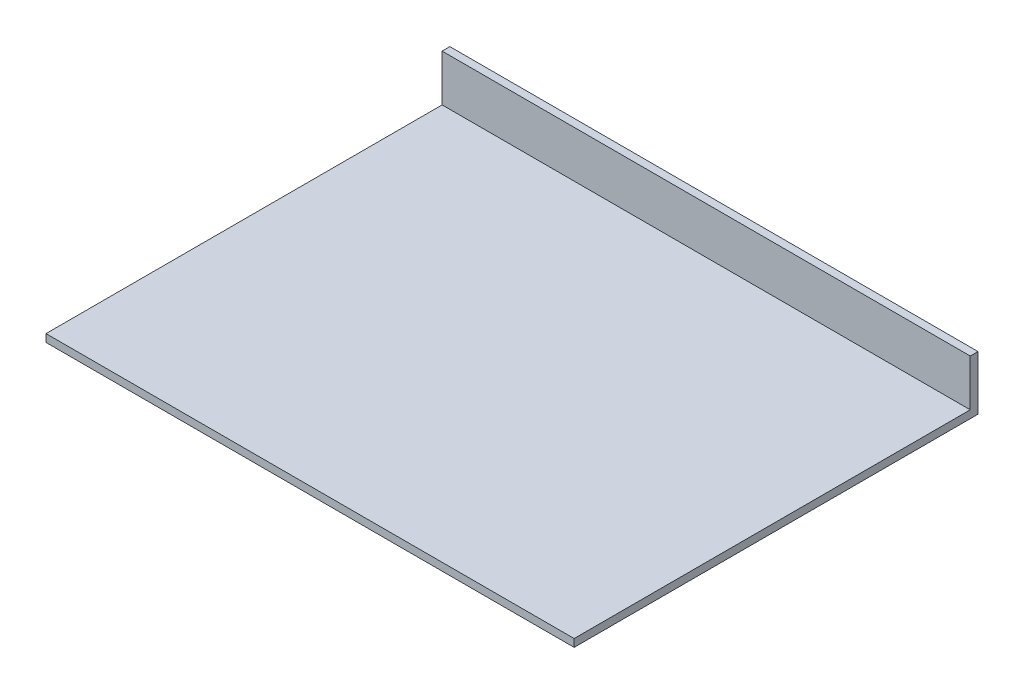
ISO-10303-21;
HEADER;
FILE_DESCRIPTION(('STEP AP214'),'2;1');
FILE_NAME('part.step','',(''),(''),'','','');
FILE_SCHEMA(('AUTOMOTIVE_DESIGN { 1 0 10303 214 1 1 1 1 }'));
ENDSEC;
DATA;
#1=APPLICATION_CONTEXT('core data for automotive mechanical design processes');
#2=APPLICATION_PROTOCOL_DEFINITION('international standard','automotive_design',2000,#1);
#3=PRODUCT_CONTEXT('',#1,'mechanical');
#4=PRODUCT('Part','Part','',(#3));
#5=PRODUCT_RELATED_PRODUCT_CATEGORY('part','',(#4));
#6=PRODUCT_DEFINITION_FORMATION('','',#4);
#7=PRODUCT_DEFINITION_CONTEXT('part definition',#1,'design');
#8=PRODUCT_DEFINITION('design','',#6,#7);
#9=PRODUCT_DEFINITION_SHAPE('','',#8);
#10=(LENGTH_UNIT() NAMED_UNIT(*) SI_UNIT(.MILLI.,.METRE.));
#11=(NAMED_UNIT(*) PLANE_ANGLE_UNIT() SI_UNIT($,.RADIAN.));
#12=(NAMED_UNIT(*) SI_UNIT($,.STERADIAN.) SOLID_ANGLE_UNIT());
#13=UNCERTAINTY_MEASURE_WITH_UNIT(LENGTH_MEASURE(1.E-05),#10,'distance_accuracy_value','');
#14=(GEOMETRIC_REPRESENTATION_CONTEXT(3) GLOBAL_UNCERTAINTY_ASSIGNED_CONTEXT((#13)) GLOBAL_UNIT_ASSIGNED_CONTEXT((#10,
#11,#12)) REPRESENTATION_CONTEXT('',''));
#15=CARTESIAN_POINT('',(0.,0.,0.));
#16=DIRECTION('',(0.,0.,1.));
#17=DIRECTION('',(1.,0.,0.));
#18=AXIS2_PLACEMENT_3D('',#15,#16,#17);
#19=CARTESIAN_POINT('',(0.,3.14770541141642,0.));
#20=DIRECTION('',(0.,-1.,0.));
#21=DIRECTION('',(0.,0.,-1.));
#22=AXIS2_PLACEMENT_3D('',#19,#20,#21);
#23=PLANE('',#22);
#24=DIRECTION('',(1.,0.,0.));
#25=VECTOR('',#24,1.);
#26=CARTESIAN_POINT('',(-107.95,3.14770541141642,-79.375));
#27=LINE('',#26,#25);
#28=CARTESIAN_POINT('',(-107.95,3.14770541141642,-79.375));
#29=VERTEX_POINT('',#28);
#30=CARTESIAN_POINT('',(107.95,3.14770541141642,-79.375));
#31=VERTEX_POINT('',#30);
#32=EDGE_CURVE('E55',#29,#31,#27,.T.);
#33=ORIENTED_EDGE('',*,*,#32,.F.);
#34=DIRECTION('',(0.,0.,1.));
#35=VECTOR('',#34,1.);
#36=CARTESIAN_POINT('',(-107.95,3.14770541141642,82.55));
#37=LINE('',#36,#35);
#38=CARTESIAN_POINT('',(-107.95,3.14770541141642,82.55));
#39=VERTEX_POINT('',#38);
#40=EDGE_CURVE('E153',#29,#39,#37,.T.);
#41=ORIENTED_EDGE('',*,*,#40,.T.);
#42=DIRECTION('',(1.,0.,0.));
#43=VECTOR('',#42,1.);
#44=CARTESIAN_POINT('',(-107.95,3.14770541141642,82.55));
#45=LINE('',#44,#43);
#46=CARTESIAN_POINT('',(107.95,3.14770541141642,82.55));
#47=VERTEX_POINT('',#46);
#48=EDGE_CURVE('E61',#39,#47,#45,.T.);
#49=ORIENTED_EDGE('',*,*,#48,.T.);
#50=DIRECTION('',(0.,0.,-1.));
#51=VECTOR('',#50,1.);
#52=CARTESIAN_POINT('',(107.95,3.14770541141642,82.55));
#53=LINE('',#52,#51);
#54=EDGE_CURVE('E91',#47,#31,#53,.T.);
#55=ORIENTED_EDGE('',*,*,#54,.T.);
#56=EDGE_LOOP('',(#33,#41,#49,#55));
#57=FACE_BOUND('',#56,.T.);
#58=ADVANCED_FACE('F39',(#57),#23,.F.);
#59=CARTESIAN_POINT('',(107.95,3.14770541141642,82.55));
#60=DIRECTION('',(-1.,0.,0.));
#61=DIRECTION('',(0.,0.,1.));
#62=AXIS2_PLACEMENT_3D('',#59,#60,#61);
#63=PLANE('',#62);
#64=DIRECTION('',(0.,0.,-1.));
#65=VECTOR('',#64,1.);
#66=CARTESIAN_POINT('',(107.95,0.,82.55));
#67=LINE('',#66,#65);
#68=CARTESIAN_POINT('',(107.95,0.,82.55));
#69=VERTEX_POINT('',#68);
#70=CARTESIAN_POINT('',(107.95,0.,-82.55));
#71=VERTEX_POINT('',#70);
#72=EDGE_CURVE('E97',#69,#71,#67,.T.);
#73=ORIENTED_EDGE('',*,*,#72,.T.);
#74=DIRECTION('',(0.,-1.,0.));
#75=VECTOR('',#74,1.);
#76=CARTESIAN_POINT('',(107.95,3.14770541141642,-82.55));
#77=LINE('',#76,#75);
#78=CARTESIAN_POINT('',(107.95,22.1977054114164,-82.55));
#79=VERTEX_POINT('',#78);
#80=EDGE_CURVE('E11',#79,#71,#77,.T.);
#81=ORIENTED_EDGE('',*,*,#80,.F.);
#82=DIRECTION('',(0.,0.,-1.));
#83=VECTOR('',#82,1.);
#84=CARTESIAN_POINT('',(107.95,22.1977054114164,-82.55));
#85=LINE('',#84,#83);
#86=CARTESIAN_POINT('',(107.95,22.1977054114164,-79.375));
#87=VERTEX_POINT('',#86);
#88=EDGE_CURVE('E140',#87,#79,#85,.T.);
#89=ORIENTED_EDGE('',*,*,#88,.F.);
#90=DIRECTION('',(0.,-1.,0.));
#91=VECTOR('',#90,1.);
#92=CARTESIAN_POINT('',(107.95,22.1977054114164,-79.375));
#93=LINE('',#92,#91);
#94=EDGE_CURVE('E110',#87,#31,#93,.T.);
#95=ORIENTED_EDGE('',*,*,#94,.T.);
#96=ORIENTED_EDGE('',*,*,#54,.F.);
#97=DIRECTION('',(0.,-1.,0.));
#98=VECTOR('',#97,1.);
#99=CARTESIAN_POINT('',(107.95,3.14770541141642,82.55));
#100=LINE('',#99,#98);
#101=EDGE_CURVE('E83',#47,#69,#100,.T.);
#102=ORIENTED_EDGE('',*,*,#101,.T.);
#103=EDGE_LOOP('',(#73,#81,#89,#95,#96,#102));
#104=FACE_BOUND('',#103,.T.);
#105=ADVANCED_FACE('F41',(#104),#63,.F.);
#106=CARTESIAN_POINT('',(-107.95,3.14770541141642,-82.55));
#107=DIRECTION('',(0.,0.,1.));
#108=DIRECTION('',(1.,0.,0.));
#109=AXIS2_PLACEMENT_3D('',#106,#107,#108);
#110=PLANE('',#109);
#111=DIRECTION('',(-1.,0.,0.));
#112=VECTOR('',#111,1.);
#113=CARTESIAN_POINT('',(-107.95,0.,-82.55));
#114=LINE('',#113,#112);
#115=CARTESIAN_POINT('',(-107.95,0.,-82.55));
#116=VERTEX_POINT('',#115);
#117=EDGE_CURVE('E102',#71,#116,#114,.T.);
#118=ORIENTED_EDGE('',*,*,#117,.T.);
#119=DIRECTION('',(0.,-1.,0.));
#120=VECTOR('',#119,1.);
#121=CARTESIAN_POINT('',(-107.95,3.14770541141642,-82.55));
#122=LINE('',#121,#120);
#123=CARTESIAN_POINT('',(-107.95,22.1977054114164,-82.55));
#124=VERTEX_POINT('',#123);
#125=EDGE_CURVE('E48',#124,#116,#122,.T.);
#126=ORIENTED_EDGE('',*,*,#125,.F.);
#127=DIRECTION('',(-1.,0.,0.));
#128=VECTOR('',#127,1.);
#129=CARTESIAN_POINT('',(-107.95,22.1977054114164,-82.55));
#130=LINE('',#129,#128);
#131=EDGE_CURVE('E132',#79,#124,#130,.T.);
#132=ORIENTED_EDGE('',*,*,#131,.F.);
#133=ORIENTED_EDGE('',*,*,#80,.T.);
#134=EDGE_LOOP('',(#118,#126,#132,#133));
#135=FACE_BOUND('',#134,.T.);
#136=ADVANCED_FACE('F130',(#135),#110,.F.);
#137=CARTESIAN_POINT('',(-107.95,3.14770541141642,82.55));
#138=DIRECTION('',(1.,0.,0.));
#139=DIRECTION('',(0.,0.,-1.));
#140=AXIS2_PLACEMENT_3D('',#137,#138,#139);
#141=PLANE('',#140);
#142=DIRECTION('',(0.,0.,1.));
#143=VECTOR('',#142,1.);
#144=CARTESIAN_POINT('',(-107.95,0.,82.55));
#145=LINE('',#144,#143);
#146=CARTESIAN_POINT('',(-107.95,0.,82.55));
#147=VERTEX_POINT('',#146);
#148=EDGE_CURVE('E92',#116,#147,#145,.T.);
#149=ORIENTED_EDGE('',*,*,#148,.T.);
#150=DIRECTION('',(0.,-1.,0.));
#151=VECTOR('',#150,1.);
#152=CARTESIAN_POINT('',(-107.95,3.14770541141642,82.55));
#153=LINE('',#152,#151);
#154=EDGE_CURVE('E86',#39,#147,#153,.T.);
#155=ORIENTED_EDGE('',*,*,#154,.F.);
#156=ORIENTED_EDGE('',*,*,#40,.F.);
#157=DIRECTION('',(0.,-1.,0.));
#158=VECTOR('',#157,1.);
#159=CARTESIAN_POINT('',(-107.95,22.1977054114164,-79.375));
#160=LINE('',#159,#158);
#161=CARTESIAN_POINT('',(-107.95,22.1977054114164,-79.375));
#162=VERTEX_POINT('',#161);
#163=EDGE_CURVE('E104',#162,#29,#160,.T.);
#164=ORIENTED_EDGE('',*,*,#163,.F.);
#165=DIRECTION('',(0.,0.,1.));
#166=VECTOR('',#165,1.);
#167=CARTESIAN_POINT('',(-107.95,22.1977054114164,-82.55));
#168=LINE('',#167,#166);
#169=EDGE_CURVE('E126',#124,#162,#168,.T.);
#170=ORIENTED_EDGE('',*,*,#169,.F.);
#171=ORIENTED_EDGE('',*,*,#125,.T.);
#172=EDGE_LOOP('',(#149,#155,#156,#164,#170,#171));
#173=FACE_BOUND('',#172,.T.);
#174=ADVANCED_FACE('F123',(#173),#141,.F.);
#175=CARTESIAN_POINT('',(-107.95,3.14770541141642,82.55));
#176=DIRECTION('',(0.,0.,-1.));
#177=DIRECTION('',(-1.,0.,0.));
#178=AXIS2_PLACEMENT_3D('',#175,#176,#177);
#179=PLANE('',#178);
#180=DIRECTION('',(1.,0.,0.));
#181=VECTOR('',#180,1.);
#182=CARTESIAN_POINT('',(-107.95,0.,82.55));
#183=LINE('',#182,#181);
#184=EDGE_CURVE('E80',#147,#69,#183,.T.);
#185=ORIENTED_EDGE('',*,*,#184,.T.);
#186=ORIENTED_EDGE('',*,*,#101,.F.);
#187=ORIENTED_EDGE('',*,*,#48,.F.);
#188=ORIENTED_EDGE('',*,*,#154,.T.);
#189=EDGE_LOOP('',(#185,#186,#187,#188));
#190=FACE_BOUND('',#189,.T.);
#191=ADVANCED_FACE('F82',(#190),#179,.F.);
#192=CARTESIAN_POINT('',(0.,0.,0.));
#193=DIRECTION('',(0.,-1.,0.));
#194=DIRECTION('',(0.,0.,-1.));
#195=AXIS2_PLACEMENT_3D('',#192,#193,#194);
#196=PLANE('',#195);
#197=ORIENTED_EDGE('',*,*,#72,.F.);
#198=ORIENTED_EDGE('',*,*,#184,.F.);
#199=ORIENTED_EDGE('',*,*,#148,.F.);
#200=ORIENTED_EDGE('',*,*,#117,.F.);
#201=EDGE_LOOP('',(#197,#198,#199,#200));
#202=FACE_BOUND('',#201,.T.);
#203=ADVANCED_FACE('F101',(#202),#196,.T.);
#204=CARTESIAN_POINT('',(-107.95,22.1977054114164,-79.375));
#205=DIRECTION('',(0.,0.,-1.));
#206=DIRECTION('',(-1.,0.,0.));
#207=AXIS2_PLACEMENT_3D('',#204,#205,#206);
#208=PLANE('',#207);
#209=ORIENTED_EDGE('',*,*,#32,.T.);
#210=ORIENTED_EDGE('',*,*,#94,.F.);
#211=DIRECTION('',(1.,0.,0.));
#212=VECTOR('',#211,1.);
#213=CARTESIAN_POINT('',(-107.95,22.1977054114164,-79.375));
#214=LINE('',#213,#212);
#215=EDGE_CURVE('E146',#162,#87,#214,.T.);
#216=ORIENTED_EDGE('',*,*,#215,.F.);
#217=ORIENTED_EDGE('',*,*,#163,.T.);
#218=EDGE_LOOP('',(#209,#210,#216,#217));
#219=FACE_BOUND('',#218,.T.);
#220=ADVANCED_FACE('F158',(#219),#208,.F.);
#221=CARTESIAN_POINT('',(0.,22.1977054114164,0.));
#222=DIRECTION('',(0.,1.,0.));
#223=DIRECTION('',(0.,0.,1.));
#224=AXIS2_PLACEMENT_3D('',#221,#222,#223);
#225=PLANE('',#224);
#226=ORIENTED_EDGE('',*,*,#169,.T.);
#227=ORIENTED_EDGE('',*,*,#215,.T.);
#228=ORIENTED_EDGE('',*,*,#88,.T.);
#229=ORIENTED_EDGE('',*,*,#131,.T.);
#230=EDGE_LOOP('',(#226,#227,#228,#229));
#231=FACE_BOUND('',#230,.T.);
#232=ADVANCED_FACE('F136',(#231),#225,.T.);
#233=CLOSED_SHELL('',(#58,#105,#136,#174,#191,#203,#220,#232));
#234=MANIFOLD_SOLID_BREP('B2',#233);
#235=ADVANCED_BREP_SHAPE_REPRESENTATION('',(#18,#234),#14);
#236=SHAPE_DEFINITION_REPRESENTATION(#9,#235);
ENDSEC;
END-ISO-10303-21;
